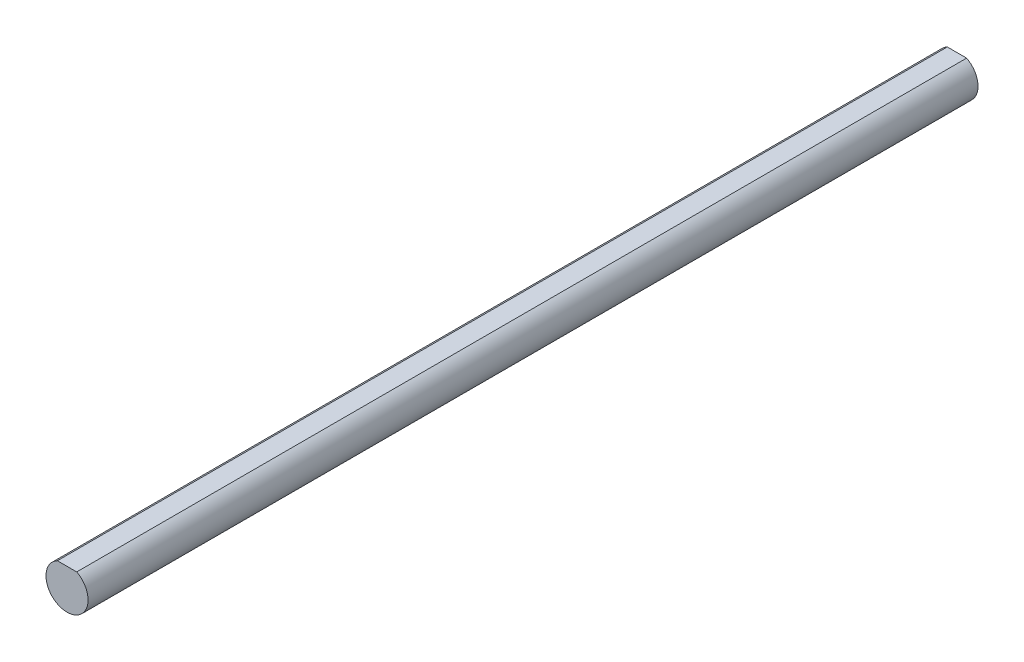
ISO-10303-21;
HEADER;
FILE_DESCRIPTION(('STEP AP214'),'2;1');
FILE_NAME('part.step','',(''),(''),'','','');
FILE_SCHEMA(('AUTOMOTIVE_DESIGN { 1 0 10303 214 1 1 1 1 }'));
ENDSEC;
DATA;
#1=APPLICATION_CONTEXT('core data for automotive mechanical design processes');
#2=APPLICATION_PROTOCOL_DEFINITION('international standard','automotive_design',2000,#1);
#3=PRODUCT_CONTEXT('',#1,'mechanical');
#4=PRODUCT('Part','Part','',(#3));
#5=PRODUCT_RELATED_PRODUCT_CATEGORY('part','',(#4));
#6=PRODUCT_DEFINITION_FORMATION('','',#4);
#7=PRODUCT_DEFINITION_CONTEXT('part definition',#1,'design');
#8=PRODUCT_DEFINITION('design','',#6,#7);
#9=PRODUCT_DEFINITION_SHAPE('','',#8);
#10=(LENGTH_UNIT() NAMED_UNIT(*) SI_UNIT(.MILLI.,.METRE.));
#11=(NAMED_UNIT(*) PLANE_ANGLE_UNIT() SI_UNIT($,.RADIAN.));
#12=(NAMED_UNIT(*) SI_UNIT($,.STERADIAN.) SOLID_ANGLE_UNIT());
#13=UNCERTAINTY_MEASURE_WITH_UNIT(LENGTH_MEASURE(1.E-05),#10,'distance_accuracy_value','');
#14=(GEOMETRIC_REPRESENTATION_CONTEXT(3) GLOBAL_UNCERTAINTY_ASSIGNED_CONTEXT((#13)) GLOBAL_UNIT_ASSIGNED_CONTEXT((#10,
#11,#12)) REPRESENTATION_CONTEXT('',''));
#15=CARTESIAN_POINT('',(0.,0.,0.));
#16=DIRECTION('',(0.,0.,1.));
#17=DIRECTION('',(1.,0.,0.));
#18=AXIS2_PLACEMENT_3D('',#15,#16,#17);
#19=CARTESIAN_POINT('',(0.,0.,50.));
#20=DIRECTION('',(0.,0.,-1.));
#21=DIRECTION('',(-1.,0.,0.));
#22=AXIS2_PLACEMENT_3D('',#19,#20,#21);
#23=CYLINDRICAL_SURFACE('',#22,2.365);
#24=DIRECTION('',(0.,0.,-1.));
#25=VECTOR('',#24,1.);
#26=CARTESIAN_POINT('',(-1.0877614628217,2.1,50.));
#27=LINE('',#26,#25);
#28=CARTESIAN_POINT('',(-1.0877614628217,2.1,50.));
#29=VERTEX_POINT('',#28);
#30=CARTESIAN_POINT('',(-1.0877614628217,2.1,-50.));
#31=VERTEX_POINT('',#30);
#32=EDGE_CURVE('E40',#29,#31,#27,.T.);
#33=ORIENTED_EDGE('',*,*,#32,.T.);
#34=CARTESIAN_POINT('',(0.,0.,-50.));
#35=DIRECTION('',(0.,0.,1.));
#36=DIRECTION('',(1.,0.,0.));
#37=AXIS2_PLACEMENT_3D('',#34,#35,#36);
#38=CIRCLE('',#37,2.365);
#39=CARTESIAN_POINT('',(1.0877614628217,2.1,-50.));
#40=VERTEX_POINT('',#39);
#41=EDGE_CURVE('E63',#31,#40,#38,.T.);
#42=ORIENTED_EDGE('',*,*,#41,.T.);
#43=DIRECTION('',(0.,0.,-1.));
#44=VECTOR('',#43,1.);
#45=CARTESIAN_POINT('',(1.0877614628217,2.1,50.));
#46=LINE('',#45,#44);
#47=CARTESIAN_POINT('',(1.0877614628217,2.1,50.));
#48=VERTEX_POINT('',#47);
#49=EDGE_CURVE('E11',#48,#40,#46,.T.);
#50=ORIENTED_EDGE('',*,*,#49,.F.);
#51=CARTESIAN_POINT('',(0.,0.,50.));
#52=DIRECTION('',(0.,0.,1.));
#53=DIRECTION('',(1.,0.,0.));
#54=AXIS2_PLACEMENT_3D('',#51,#52,#53);
#55=CIRCLE('',#54,2.365);
#56=EDGE_CURVE('E67',#29,#48,#55,.T.);
#57=ORIENTED_EDGE('',*,*,#56,.F.);
#58=EDGE_LOOP('',(#33,#42,#50,#57));
#59=FACE_BOUND('',#58,.T.);
#60=ADVANCED_FACE('F33',(#59),#23,.T.);
#61=CARTESIAN_POINT('',(1.0877614628217,2.1,50.));
#62=DIRECTION('',(0.,-1.,0.));
#63=DIRECTION('',(0.,0.,-1.));
#64=AXIS2_PLACEMENT_3D('',#61,#62,#63);
#65=PLANE('',#64);
#66=ORIENTED_EDGE('',*,*,#49,.T.);
#67=DIRECTION('',(-1.,0.,0.));
#68=VECTOR('',#67,1.);
#69=CARTESIAN_POINT('',(1.0877614628217,2.1,-50.));
#70=LINE('',#69,#68);
#71=EDGE_CURVE('E59',#40,#31,#70,.T.);
#72=ORIENTED_EDGE('',*,*,#71,.T.);
#73=ORIENTED_EDGE('',*,*,#32,.F.);
#74=DIRECTION('',(-1.,0.,0.));
#75=VECTOR('',#74,1.);
#76=CARTESIAN_POINT('',(1.0877614628217,2.1,50.));
#77=LINE('',#76,#75);
#78=EDGE_CURVE('E46',#48,#29,#77,.T.);
#79=ORIENTED_EDGE('',*,*,#78,.F.);
#80=EDGE_LOOP('',(#66,#72,#73,#79));
#81=FACE_BOUND('',#80,.T.);
#82=ADVANCED_FACE('F57',(#81),#65,.F.);
#83=CARTESIAN_POINT('',(0.,0.,50.));
#84=DIRECTION('',(0.,0.,1.));
#85=DIRECTION('',(1.,0.,0.));
#86=AXIS2_PLACEMENT_3D('',#83,#84,#85);
#87=PLANE('',#86);
#88=ORIENTED_EDGE('',*,*,#56,.T.);
#89=ORIENTED_EDGE('',*,*,#78,.T.);
#90=EDGE_LOOP('',(#88,#89));
#91=FACE_BOUND('',#90,.T.);
#92=ADVANCED_FACE('F71',(#91),#87,.T.);
#93=CARTESIAN_POINT('',(0.,0.,-50.));
#94=DIRECTION('',(0.,0.,1.));
#95=DIRECTION('',(1.,0.,0.));
#96=AXIS2_PLACEMENT_3D('',#93,#94,#95);
#97=PLANE('',#96);
#98=ORIENTED_EDGE('',*,*,#41,.F.);
#99=ORIENTED_EDGE('',*,*,#71,.F.);
#100=EDGE_LOOP('',(#98,#99));
#101=FACE_BOUND('',#100,.T.);
#102=ADVANCED_FACE('F66',(#101),#97,.F.);
#103=CLOSED_SHELL('',(#60,#82,#92,#102));
#104=MANIFOLD_SOLID_BREP('B2',#103);
#105=ADVANCED_BREP_SHAPE_REPRESENTATION('',(#18,#104),#14);
#106=SHAPE_DEFINITION_REPRESENTATION(#9,#105);
ENDSEC;
END-ISO-10303-21;
